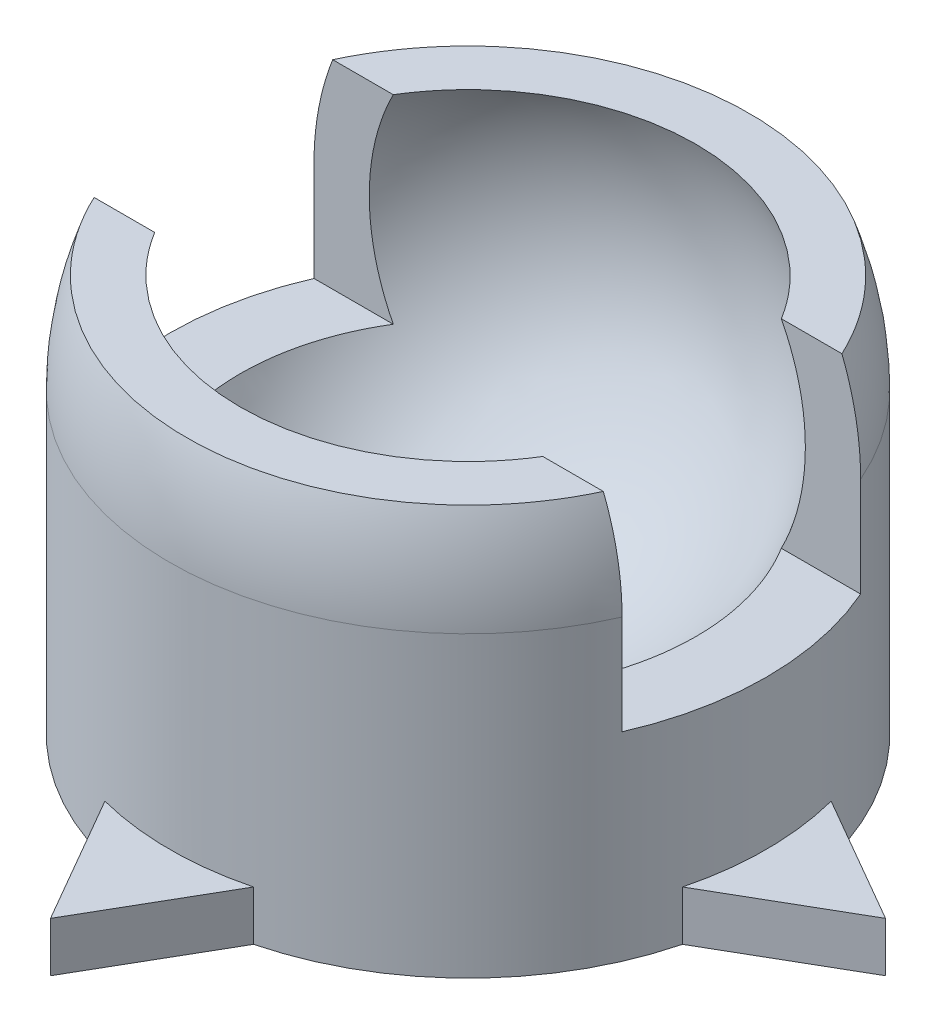
ISO-10303-21;
HEADER;
FILE_DESCRIPTION(('STEP AP214'),'2;1');
FILE_NAME('part.step','',(''),(''),'','','');
FILE_SCHEMA(('AUTOMOTIVE_DESIGN { 1 0 10303 214 1 1 1 1 }'));
ENDSEC;
DATA;
#1=APPLICATION_CONTEXT('core data for automotive mechanical design processes');
#2=APPLICATION_PROTOCOL_DEFINITION('international standard','automotive_design',2000,#1);
#3=PRODUCT_CONTEXT('',#1,'mechanical');
#4=PRODUCT('Part','Part','',(#3));
#5=PRODUCT_RELATED_PRODUCT_CATEGORY('part','',(#4));
#6=PRODUCT_DEFINITION_FORMATION('','',#4);
#7=PRODUCT_DEFINITION_CONTEXT('part definition',#1,'design');
#8=PRODUCT_DEFINITION('design','',#6,#7);
#9=PRODUCT_DEFINITION_SHAPE('','',#8);
#10=(LENGTH_UNIT() NAMED_UNIT(*) SI_UNIT(.MILLI.,.METRE.));
#11=(NAMED_UNIT(*) PLANE_ANGLE_UNIT() SI_UNIT($,.RADIAN.));
#12=(NAMED_UNIT(*) SI_UNIT($,.STERADIAN.) SOLID_ANGLE_UNIT());
#13=UNCERTAINTY_MEASURE_WITH_UNIT(LENGTH_MEASURE(1.E-05),#10,'distance_accuracy_value','');
#14=(GEOMETRIC_REPRESENTATION_CONTEXT(3) GLOBAL_UNCERTAINTY_ASSIGNED_CONTEXT((#13)) GLOBAL_UNIT_ASSIGNED_CONTEXT((#10,
#11,#12)) REPRESENTATION_CONTEXT('',''));
#15=CARTESIAN_POINT('',(0.,0.,0.));
#16=DIRECTION('',(0.,0.,1.));
#17=DIRECTION('',(1.,0.,0.));
#18=AXIS2_PLACEMENT_3D('',#15,#16,#17);
#19=CARTESIAN_POINT('',(0.,-7.5,0.));
#20=DIRECTION('',(0.,1.,0.));
#21=DIRECTION('',(0.,0.,1.));
#22=AXIS2_PLACEMENT_3D('',#19,#20,#21);
#23=CYLINDRICAL_SURFACE('',#22,7.5);
#24=CARTESIAN_POINT('',(0.,-2.5,0.));
#25=DIRECTION('',(0.,-1.,0.));
#26=DIRECTION('',(0.,0.,-1.));
#27=AXIS2_PLACEMENT_3D('',#24,#25,#26);
#28=CIRCLE('',#27,7.5);
#29=CARTESIAN_POINT('',(6.87386354243376,-2.5,3.));
#30=VERTEX_POINT('',#29);
#31=CARTESIAN_POINT('',(6.87386354243376,-2.5,-3.));
#32=VERTEX_POINT('',#31);
#33=EDGE_CURVE('E330',#30,#32,#28,.F.);
#34=ORIENTED_EDGE('',*,*,#33,.F.);
#35=DIRECTION('',(0.,1.,0.));
#36=VECTOR('',#35,1.);
#37=CARTESIAN_POINT('',(6.87386354243376,-7.5,3.));
#38=LINE('',#37,#36);
#39=CARTESIAN_POINT('',(6.87386354243376,0.,3.));
#40=VERTEX_POINT('',#39);
#41=EDGE_CURVE('E326',#40,#30,#38,.F.);
#42=ORIENTED_EDGE('',*,*,#41,.F.);
#43=CARTESIAN_POINT('',(0.,0.,0.));
#44=DIRECTION('',(0.,1.,0.));
#45=DIRECTION('',(0.,0.,1.));
#46=AXIS2_PLACEMENT_3D('',#43,#44,#45);
#47=CIRCLE('',#46,7.5);
#48=CARTESIAN_POINT('',(-6.87386354243376,0.,3.));
#49=VERTEX_POINT('',#48);
#50=EDGE_CURVE('E343',#49,#40,#47,.T.);
#51=ORIENTED_EDGE('',*,*,#50,.F.);
#52=DIRECTION('',(0.,1.,0.));
#53=VECTOR('',#52,1.);
#54=CARTESIAN_POINT('',(-6.87386354243376,-7.5,3.));
#55=LINE('',#54,#53);
#56=CARTESIAN_POINT('',(-6.87386354243376,-2.5,3.));
#57=VERTEX_POINT('',#56);
#58=EDGE_CURVE('E316',#57,#49,#55,.T.);
#59=ORIENTED_EDGE('',*,*,#58,.F.);
#60=CARTESIAN_POINT('',(-6.87386354243376,-2.5,-3.));
#61=VERTEX_POINT('',#60);
#62=EDGE_CURVE('E331',#61,#57,#28,.F.);
#63=ORIENTED_EDGE('',*,*,#62,.F.);
#64=DIRECTION('',(0.,1.,0.));
#65=VECTOR('',#64,1.);
#66=CARTESIAN_POINT('',(-6.87386354243376,-7.5,-3.));
#67=LINE('',#66,#65);
#68=CARTESIAN_POINT('',(-6.87386354243376,0.,-3.));
#69=VERTEX_POINT('',#68);
#70=EDGE_CURVE('E335',#69,#61,#67,.F.);
#71=ORIENTED_EDGE('',*,*,#70,.F.);
#72=CARTESIAN_POINT('',(6.87386354243376,0.,-3.));
#73=VERTEX_POINT('',#72);
#74=EDGE_CURVE('E354',#73,#69,#47,.T.);
#75=ORIENTED_EDGE('',*,*,#74,.F.);
#76=DIRECTION('',(0.,1.,0.));
#77=VECTOR('',#76,1.);
#78=CARTESIAN_POINT('',(6.87386354243376,-7.5,-3.));
#79=LINE('',#78,#77);
#80=EDGE_CURVE('E339',#32,#73,#79,.T.);
#81=ORIENTED_EDGE('',*,*,#80,.F.);
#82=EDGE_LOOP('',(#34,#42,#51,#59,#63,#71,#75,#81));
#83=FACE_BOUND('',#82,.T.);
#84=CARTESIAN_POINT('',(0.,-6.25,0.));
#85=DIRECTION('',(0.,-1.,0.));
#86=DIRECTION('',(0.,0.,1.));
#87=AXIS2_PLACEMENT_3D('',#84,#85,#86);
#88=CIRCLE('',#87,7.5);
#89=CARTESIAN_POINT('',(-1.86859770916472,-6.25,-7.26349382881987));
#90=VERTEX_POINT('',#89);
#91=CARTESIAN_POINT('',(1.86859770916472,-6.25,-7.26349382881987));
#92=VERTEX_POINT('',#91);
#93=EDGE_CURVE('E60',#90,#92,#88,.T.);
#94=ORIENTED_EDGE('',*,*,#93,.F.);
#95=DIRECTION('',(0.,-1.,0.));
#96=VECTOR('',#95,1.);
#97=CARTESIAN_POINT('',(-1.86859770916472,-6.25,-7.26349382881987));
#98=LINE('',#97,#96);
#99=CARTESIAN_POINT('',(-1.86859770916472,-7.5,-7.26349382881987));
#100=VERTEX_POINT('',#99);
#101=EDGE_CURVE('E211',#90,#100,#98,.T.);
#102=ORIENTED_EDGE('',*,*,#101,.T.);
#103=CARTESIAN_POINT('',(0.,-7.5,0.));
#104=DIRECTION('',(0.,1.,0.));
#105=DIRECTION('',(0.,0.,1.));
#106=AXIS2_PLACEMENT_3D('',#103,#104,#105);
#107=CIRCLE('',#106,7.5);
#108=CARTESIAN_POINT('',(-7.26349382881987,-7.5,-1.86859770916474));
#109=VERTEX_POINT('',#108);
#110=EDGE_CURVE('E349',#100,#109,#107,.T.);
#111=ORIENTED_EDGE('',*,*,#110,.T.);
#112=DIRECTION('',(0.,-1.,0.));
#113=VECTOR('',#112,1.);
#114=CARTESIAN_POINT('',(-7.26349382881987,-6.25,-1.86859770916474));
#115=LINE('',#114,#113);
#116=CARTESIAN_POINT('',(-7.26349382881987,-6.25,-1.86859770916474));
#117=VERTEX_POINT('',#116);
#118=EDGE_CURVE('E317',#117,#109,#115,.T.);
#119=ORIENTED_EDGE('',*,*,#118,.F.);
#120=CARTESIAN_POINT('',(0.,-6.25,0.));
#121=DIRECTION('',(0.,1.,0.));
#122=DIRECTION('',(0.,0.,-1.));
#123=AXIS2_PLACEMENT_3D('',#120,#121,#122);
#124=CIRCLE('',#123,7.5);
#125=CARTESIAN_POINT('',(-7.26349382881987,-6.25,1.86859770916474));
#126=VERTEX_POINT('',#125);
#127=EDGE_CURVE('E302',#117,#126,#124,.T.);
#128=ORIENTED_EDGE('',*,*,#127,.T.);
#129=DIRECTION('',(0.,-1.,0.));
#130=VECTOR('',#129,1.);
#131=CARTESIAN_POINT('',(-7.26349382881987,-6.25,1.86859770916474));
#132=LINE('',#131,#130);
#133=CARTESIAN_POINT('',(-7.26349382881987,-7.5,1.86859770916474));
#134=VERTEX_POINT('',#133);
#135=EDGE_CURVE('E312',#126,#134,#132,.T.);
#136=ORIENTED_EDGE('',*,*,#135,.T.);
#137=CARTESIAN_POINT('',(-1.86859770916472,-7.5,7.26349382881987));
#138=VERTEX_POINT('',#137);
#139=EDGE_CURVE('E344',#134,#138,#107,.T.);
#140=ORIENTED_EDGE('',*,*,#139,.T.);
#141=DIRECTION('',(0.,-1.,0.));
#142=VECTOR('',#141,1.);
#143=CARTESIAN_POINT('',(-1.86859770916472,-6.25,7.26349382881987));
#144=LINE('',#143,#142);
#145=CARTESIAN_POINT('',(-1.86859770916472,-6.25,7.26349382881987));
#146=VERTEX_POINT('',#145);
#147=EDGE_CURVE('E239',#146,#138,#144,.T.);
#148=ORIENTED_EDGE('',*,*,#147,.F.);
#149=CARTESIAN_POINT('',(0.,-6.25,0.));
#150=DIRECTION('',(0.,1.,0.));
#151=DIRECTION('',(0.,0.,-1.));
#152=AXIS2_PLACEMENT_3D('',#149,#150,#151);
#153=CIRCLE('',#152,7.5);
#154=CARTESIAN_POINT('',(1.86859770916472,-6.25,7.26349382881987));
#155=VERTEX_POINT('',#154);
#156=EDGE_CURVE('E231',#146,#155,#153,.T.);
#157=ORIENTED_EDGE('',*,*,#156,.T.);
#158=DIRECTION('',(0.,-1.,0.));
#159=VECTOR('',#158,1.);
#160=CARTESIAN_POINT('',(1.86859770916472,-6.25,7.26349382881987));
#161=LINE('',#160,#159);
#162=CARTESIAN_POINT('',(1.86859770916472,-7.5,7.26349382881987));
#163=VERTEX_POINT('',#162);
#164=EDGE_CURVE('E250',#155,#163,#161,.T.);
#165=ORIENTED_EDGE('',*,*,#164,.T.);
#166=CARTESIAN_POINT('',(7.26349382881987,-7.5,1.86859770916474));
#167=VERTEX_POINT('',#166);
#168=EDGE_CURVE('E348',#163,#167,#107,.T.);
#169=ORIENTED_EDGE('',*,*,#168,.T.);
#170=DIRECTION('',(0.,-1.,0.));
#171=VECTOR('',#170,1.);
#172=CARTESIAN_POINT('',(7.26349382881987,-6.25,1.86859770916474));
#173=LINE('',#172,#171);
#174=CARTESIAN_POINT('',(7.26349382881987,-6.25,1.86859770916474));
#175=VERTEX_POINT('',#174);
#176=EDGE_CURVE('E274',#175,#167,#173,.T.);
#177=ORIENTED_EDGE('',*,*,#176,.F.);
#178=CARTESIAN_POINT('',(0.,-6.25,0.));
#179=DIRECTION('',(0.,-1.,0.));
#180=DIRECTION('',(0.,0.,-1.));
#181=AXIS2_PLACEMENT_3D('',#178,#179,#180);
#182=CIRCLE('',#181,7.5);
#183=CARTESIAN_POINT('',(7.26349382881987,-6.25,-1.86859770916474));
#184=VERTEX_POINT('',#183);
#185=EDGE_CURVE('E265',#184,#175,#182,.T.);
#186=ORIENTED_EDGE('',*,*,#185,.F.);
#187=DIRECTION('',(0.,-1.,0.));
#188=VECTOR('',#187,1.);
#189=CARTESIAN_POINT('',(7.26349382881987,-6.25,-1.86859770916474));
#190=LINE('',#189,#188);
#191=CARTESIAN_POINT('',(7.26349382881987,-7.5,-1.86859770916474));
#192=VERTEX_POINT('',#191);
#193=EDGE_CURVE('E286',#184,#192,#190,.T.);
#194=ORIENTED_EDGE('',*,*,#193,.T.);
#195=CARTESIAN_POINT('',(1.86859770916472,-7.5,-7.26349382881987));
#196=VERTEX_POINT('',#195);
#197=EDGE_CURVE('E350',#192,#196,#107,.T.);
#198=ORIENTED_EDGE('',*,*,#197,.T.);
#199=DIRECTION('',(0.,-1.,0.));
#200=VECTOR('',#199,1.);
#201=CARTESIAN_POINT('',(1.86859770916472,-6.25,-7.26349382881987));
#202=LINE('',#201,#200);
#203=EDGE_CURVE('E65',#92,#196,#202,.T.);
#204=ORIENTED_EDGE('',*,*,#203,.F.);
#205=EDGE_LOOP('',(#94,#102,#111,#119,#128,#136,#140,#148,#157,#165,#169,#177,#186,#194,#198,#204));
#206=FACE_BOUND('',#205,.T.);
#207=ADVANCED_FACE('F43',(#83,#206),#23,.T.);
#208=CARTESIAN_POINT('',(0.,0.,0.));
#209=DIRECTION('',(1.,0.,0.));
#210=DIRECTION('',(0.,0.,-1.));
#211=AXIS2_PLACEMENT_3D('',#208,#209,#210);
#212=SPHERICAL_SURFACE('',#211,7.5);
#213=CARTESIAN_POINT('',(0.,0.,-3.));
#214=DIRECTION('',(0.,0.,-1.));
#215=DIRECTION('',(0.,1.,0.));
#216=AXIS2_PLACEMENT_3D('',#213,#214,#215);
#217=CIRCLE('',#216,6.87386354243376);
#218=CARTESIAN_POINT('',(6.40312423743285,2.5,-3.));
#219=VERTEX_POINT('',#218);
#220=EDGE_CURVE('E11',#219,#73,#217,.T.);
#221=ORIENTED_EDGE('',*,*,#220,.T.);
#222=ORIENTED_EDGE('',*,*,#74,.T.);
#223=CARTESIAN_POINT('',(-6.40312423743285,2.5,-3.));
#224=VERTEX_POINT('',#223);
#225=EDGE_CURVE('E47',#69,#224,#217,.T.);
#226=ORIENTED_EDGE('',*,*,#225,.T.);
#227=CARTESIAN_POINT('',(0.,2.5,0.));
#228=DIRECTION('',(0.,-1.,0.));
#229=DIRECTION('',(0.,0.,-1.));
#230=AXIS2_PLACEMENT_3D('',#227,#228,#229);
#231=CIRCLE('',#230,7.07106781186548);
#232=EDGE_CURVE('E391',#224,#219,#231,.T.);
#233=ORIENTED_EDGE('',*,*,#232,.T.);
#234=EDGE_LOOP('',(#221,#222,#226,#233));
#235=FACE_BOUND('',#234,.T.);
#236=ADVANCED_FACE('F472',(#235),#212,.T.);
#237=CARTESIAN_POINT('',(0.,2.5,0.));
#238=DIRECTION('',(0.,-1.,0.));
#239=DIRECTION('',(0.,0.,-1.));
#240=AXIS2_PLACEMENT_3D('',#237,#238,#239);
#241=PLANE('',#240);
#242=ORIENTED_EDGE('',*,*,#232,.F.);
#243=DIRECTION('',(1.,0.,0.));
#244=VECTOR('',#243,1.);
#245=CARTESIAN_POINT('',(-12.5,2.5,-3.));
#246=LINE('',#245,#244);
#247=CARTESIAN_POINT('',(-4.87980532398579,2.5,-3.));
#248=VERTEX_POINT('',#247);
#249=EDGE_CURVE('E372',#224,#248,#246,.T.);
#250=ORIENTED_EDGE('',*,*,#249,.T.);
#251=CARTESIAN_POINT('',(0.,2.5,0.));
#252=DIRECTION('',(0.,-1.,0.));
#253=DIRECTION('',(0.,0.,-1.));
#254=AXIS2_PLACEMENT_3D('',#251,#252,#253);
#255=CIRCLE('',#254,5.7282196186948);
#256=CARTESIAN_POINT('',(4.87980532398579,2.5,-3.));
#257=VERTEX_POINT('',#256);
#258=EDGE_CURVE('E397',#257,#248,#255,.F.);
#259=ORIENTED_EDGE('',*,*,#258,.F.);
#260=EDGE_CURVE('E358',#257,#219,#246,.T.);
#261=ORIENTED_EDGE('',*,*,#260,.T.);
#262=EDGE_LOOP('',(#242,#250,#259,#261));
#263=FACE_BOUND('',#262,.T.);
#264=ADVANCED_FACE('F448',(#263),#241,.F.);
#265=CARTESIAN_POINT('',(0.,0.,0.));
#266=DIRECTION('',(1.,0.,0.));
#267=DIRECTION('',(0.,0.,1.));
#268=AXIS2_PLACEMENT_3D('',#265,#266,#267);
#269=SPHERICAL_SURFACE('',#268,6.25);
#270=CARTESIAN_POINT('',(0.,-6.0673305497558,0.));
#271=DIRECTION('',(0.,1.,0.));
#272=DIRECTION('',(0.,0.,1.));
#273=AXIS2_PLACEMENT_3D('',#270,#271,#272);
#274=CIRCLE('',#273,1.5);
#275=CARTESIAN_POINT('',(0.,-6.0673305497558,1.5));
#276=VERTEX_POINT('',#275);
#277=EDGE_CURVE('E347',#276,#276,#274,.F.);
#278=ORIENTED_EDGE('',*,*,#277,.T.);
#279=EDGE_LOOP('',(#278));
#280=FACE_BOUND('',#279,.T.);
#281=ORIENTED_EDGE('',*,*,#258,.T.);
#282=CARTESIAN_POINT('',(0.,0.,-3.));
#283=DIRECTION('',(0.,0.,-1.));
#284=DIRECTION('',(0.,1.,0.));
#285=AXIS2_PLACEMENT_3D('',#282,#283,#284);
#286=CIRCLE('',#285,5.48292804986533);
#287=CARTESIAN_POINT('',(-4.87980532398578,-2.5,-3.));
#288=VERTEX_POINT('',#287);
#289=EDGE_CURVE('E390',#248,#288,#286,.F.);
#290=ORIENTED_EDGE('',*,*,#289,.T.);
#291=CARTESIAN_POINT('',(0.,-2.5,0.));
#292=DIRECTION('',(0.,-1.,0.));
#293=DIRECTION('',(0.,0.,-1.));
#294=AXIS2_PLACEMENT_3D('',#291,#292,#293);
#295=CIRCLE('',#294,5.7282196186948);
#296=CARTESIAN_POINT('',(-4.87980532398578,-2.5,3.));
#297=VERTEX_POINT('',#296);
#298=EDGE_CURVE('E385',#288,#297,#295,.F.);
#299=ORIENTED_EDGE('',*,*,#298,.T.);
#300=CARTESIAN_POINT('',(0.,0.,3.));
#301=DIRECTION('',(0.,0.,1.));
#302=DIRECTION('',(0.,-1.,0.));
#303=AXIS2_PLACEMENT_3D('',#300,#301,#302);
#304=CIRCLE('',#303,5.48292804986533);
#305=CARTESIAN_POINT('',(-4.87980532398578,2.5,3.));
#306=VERTEX_POINT('',#305);
#307=EDGE_CURVE('E380',#297,#306,#304,.F.);
#308=ORIENTED_EDGE('',*,*,#307,.T.);
#309=CARTESIAN_POINT('',(4.87980532398578,2.5,3.));
#310=VERTEX_POINT('',#309);
#311=EDGE_CURVE('E396',#306,#310,#255,.F.);
#312=ORIENTED_EDGE('',*,*,#311,.T.);
#313=CARTESIAN_POINT('',(4.87980532398578,-2.5,3.));
#314=VERTEX_POINT('',#313);
#315=EDGE_CURVE('E376',#310,#314,#304,.F.);
#316=ORIENTED_EDGE('',*,*,#315,.T.);
#317=CARTESIAN_POINT('',(4.87980532398578,-2.5,-3.));
#318=VERTEX_POINT('',#317);
#319=EDGE_CURVE('E381',#314,#318,#295,.F.);
#320=ORIENTED_EDGE('',*,*,#319,.T.);
#321=EDGE_CURVE('E386',#318,#257,#286,.F.);
#322=ORIENTED_EDGE('',*,*,#321,.T.);
#323=EDGE_LOOP('',(#281,#290,#299,#308,#312,#316,#320,#322));
#324=FACE_BOUND('',#323,.T.);
#325=ADVANCED_FACE('F45',(#280,#324),#269,.F.);
#326=CARTESIAN_POINT('',(6.40312423743285,2.5,3.));
#327=VERTEX_POINT('',#326);
#328=CARTESIAN_POINT('',(-6.40312423743285,2.5,3.));
#329=VERTEX_POINT('',#328);
#330=EDGE_CURVE('E395',#327,#329,#231,.T.);
#331=ORIENTED_EDGE('',*,*,#330,.F.);
#332=DIRECTION('',(1.,0.,0.));
#333=VECTOR('',#332,1.);
#334=CARTESIAN_POINT('',(-12.5,2.5,3.));
#335=LINE('',#334,#333);
#336=EDGE_CURVE('E368',#310,#327,#335,.T.);
#337=ORIENTED_EDGE('',*,*,#336,.F.);
#338=ORIENTED_EDGE('',*,*,#311,.F.);
#339=EDGE_CURVE('E367',#329,#306,#335,.T.);
#340=ORIENTED_EDGE('',*,*,#339,.F.);
#341=EDGE_LOOP('',(#331,#337,#338,#340));
#342=FACE_BOUND('',#341,.T.);
#343=ADVANCED_FACE('F419',(#342),#241,.F.);
#344=CARTESIAN_POINT('',(0.,0.,3.));
#345=DIRECTION('',(0.,0.,1.));
#346=DIRECTION('',(0.,-1.,0.));
#347=AXIS2_PLACEMENT_3D('',#344,#345,#346);
#348=CIRCLE('',#347,6.87386354243376);
#349=EDGE_CURVE('E400',#329,#49,#348,.T.);
#350=ORIENTED_EDGE('',*,*,#349,.T.);
#351=ORIENTED_EDGE('',*,*,#50,.T.);
#352=EDGE_CURVE('E53',#40,#327,#348,.T.);
#353=ORIENTED_EDGE('',*,*,#352,.T.);
#354=ORIENTED_EDGE('',*,*,#330,.T.);
#355=EDGE_LOOP('',(#350,#351,#353,#354));
#356=FACE_BOUND('',#355,.T.);
#357=ADVANCED_FACE('F407',(#356),#212,.T.);
#358=CARTESIAN_POINT('',(-12.5,2.5,3.));
#359=DIRECTION('',(0.,0.,1.));
#360=DIRECTION('',(0.,-1.,0.));
#361=AXIS2_PLACEMENT_3D('',#358,#359,#360);
#362=PLANE('',#361);
#363=DIRECTION('',(1.,0.,0.));
#364=VECTOR('',#363,1.);
#365=CARTESIAN_POINT('',(-12.5,-2.5,3.));
#366=LINE('',#365,#364);
#367=EDGE_CURVE('E363',#57,#297,#366,.T.);
#368=ORIENTED_EDGE('',*,*,#367,.F.);
#369=ORIENTED_EDGE('',*,*,#58,.T.);
#370=ORIENTED_EDGE('',*,*,#349,.F.);
#371=ORIENTED_EDGE('',*,*,#339,.T.);
#372=ORIENTED_EDGE('',*,*,#307,.F.);
#373=EDGE_LOOP('',(#368,#369,#370,#371,#372));
#374=FACE_BOUND('',#373,.T.);
#375=ADVANCED_FACE('F464',(#374),#362,.F.);
#376=CARTESIAN_POINT('',(-12.5,-2.5,3.));
#377=DIRECTION('',(0.,-1.,0.));
#378=DIRECTION('',(0.,0.,-1.));
#379=AXIS2_PLACEMENT_3D('',#376,#377,#378);
#380=PLANE('',#379);
#381=ORIENTED_EDGE('',*,*,#298,.F.);
#382=DIRECTION('',(1.,0.,0.));
#383=VECTOR('',#382,1.);
#384=CARTESIAN_POINT('',(-12.5,-2.5,-3.));
#385=LINE('',#384,#383);
#386=EDGE_CURVE('E362',#61,#288,#385,.T.);
#387=ORIENTED_EDGE('',*,*,#386,.F.);
#388=ORIENTED_EDGE('',*,*,#62,.T.);
#389=ORIENTED_EDGE('',*,*,#367,.T.);
#390=EDGE_LOOP('',(#381,#387,#388,#389));
#391=FACE_BOUND('',#390,.T.);
#392=ADVANCED_FACE('F461',(#391),#380,.F.);
#393=CARTESIAN_POINT('',(-12.5,-2.5,-3.));
#394=DIRECTION('',(0.,0.,-1.));
#395=DIRECTION('',(0.,1.,0.));
#396=AXIS2_PLACEMENT_3D('',#393,#394,#395);
#397=PLANE('',#396);
#398=ORIENTED_EDGE('',*,*,#225,.F.);
#399=ORIENTED_EDGE('',*,*,#70,.T.);
#400=ORIENTED_EDGE('',*,*,#386,.T.);
#401=ORIENTED_EDGE('',*,*,#289,.F.);
#402=ORIENTED_EDGE('',*,*,#249,.F.);
#403=EDGE_LOOP('',(#398,#399,#400,#401,#402));
#404=FACE_BOUND('',#403,.T.);
#405=ADVANCED_FACE('F452',(#404),#397,.F.);
#406=EDGE_CURVE('E359',#318,#32,#385,.T.);
#407=ORIENTED_EDGE('',*,*,#406,.T.);
#408=ORIENTED_EDGE('',*,*,#80,.T.);
#409=ORIENTED_EDGE('',*,*,#220,.F.);
#410=ORIENTED_EDGE('',*,*,#260,.F.);
#411=ORIENTED_EDGE('',*,*,#321,.F.);
#412=EDGE_LOOP('',(#407,#408,#409,#410,#411));
#413=FACE_BOUND('',#412,.T.);
#414=ADVANCED_FACE('F442',(#413),#397,.F.);
#415=EDGE_CURVE('E364',#314,#30,#366,.T.);
#416=ORIENTED_EDGE('',*,*,#415,.T.);
#417=ORIENTED_EDGE('',*,*,#33,.T.);
#418=ORIENTED_EDGE('',*,*,#406,.F.);
#419=ORIENTED_EDGE('',*,*,#319,.F.);
#420=EDGE_LOOP('',(#416,#417,#418,#419));
#421=FACE_BOUND('',#420,.T.);
#422=ADVANCED_FACE('F437',(#421),#380,.F.);
#423=ORIENTED_EDGE('',*,*,#352,.F.);
#424=ORIENTED_EDGE('',*,*,#41,.T.);
#425=ORIENTED_EDGE('',*,*,#415,.F.);
#426=ORIENTED_EDGE('',*,*,#315,.F.);
#427=ORIENTED_EDGE('',*,*,#336,.T.);
#428=EDGE_LOOP('',(#423,#424,#425,#426,#427));
#429=FACE_BOUND('',#428,.T.);
#430=ADVANCED_FACE('F413',(#429),#362,.F.);
#431=CARTESIAN_POINT('',(0.,7.5,0.));
#432=DIRECTION('',(0.,-1.,0.));
#433=DIRECTION('',(0.,0.,-1.));
#434=AXIS2_PLACEMENT_3D('',#431,#432,#433);
#435=CYLINDRICAL_SURFACE('',#434,1.5);
#436=ORIENTED_EDGE('',*,*,#277,.F.);
#437=EDGE_LOOP('',(#436));
#438=FACE_BOUND('',#437,.T.);
#439=CARTESIAN_POINT('',(0.,-7.5,0.));
#440=DIRECTION('',(0.,-1.,0.));
#441=DIRECTION('',(0.,0.,-1.));
#442=AXIS2_PLACEMENT_3D('',#439,#440,#441);
#443=CIRCLE('',#442,1.5);
#444=CARTESIAN_POINT('',(0.,-7.5,-1.5));
#445=VERTEX_POINT('',#444);
#446=EDGE_CURVE('E249',#445,#445,#443,.T.);
#447=ORIENTED_EDGE('',*,*,#446,.T.);
#448=EDGE_LOOP('',(#447));
#449=FACE_BOUND('',#448,.T.);
#450=ADVANCED_FACE('F475',(#438,#449),#435,.F.);
#451=CARTESIAN_POINT('',(0.,-7.5,0.));
#452=DIRECTION('',(0.,1.,0.));
#453=DIRECTION('',(0.,0.,1.));
#454=AXIS2_PLACEMENT_3D('',#451,#452,#453);
#455=PLANE('',#454);
#456=ORIENTED_EDGE('',*,*,#446,.F.);
#457=EDGE_LOOP('',(#456));
#458=FACE_BOUND('',#457,.T.);
#459=ORIENTED_EDGE('',*,*,#139,.F.);
#460=DIRECTION('',(-0.866025403784438,0.,-0.500000000000001));
#461=VECTOR('',#460,1.);
#462=CARTESIAN_POINT('',(-10.5,-7.5,0.));
#463=LINE('',#462,#461);
#464=CARTESIAN_POINT('',(-10.5,-7.5,0.));
#465=VERTEX_POINT('',#464);
#466=EDGE_CURVE('E285',#134,#465,#463,.T.);
#467=ORIENTED_EDGE('',*,*,#466,.T.);
#468=DIRECTION('',(0.866025403784438,0.,-0.500000000000001));
#469=VECTOR('',#468,1.);
#470=CARTESIAN_POINT('',(-10.5,-7.5,0.));
#471=LINE('',#470,#469);
#472=EDGE_CURVE('E298',#465,#109,#471,.T.);
#473=ORIENTED_EDGE('',*,*,#472,.T.);
#474=ORIENTED_EDGE('',*,*,#110,.F.);
#475=DIRECTION('',(-0.499999999999998,0.,0.866025403784439));
#476=VECTOR('',#475,1.);
#477=CARTESIAN_POINT('',(0.,-7.5,-10.5));
#478=LINE('',#477,#476);
#479=CARTESIAN_POINT('',(0.,-7.5,-10.5));
#480=VERTEX_POINT('',#479);
#481=EDGE_CURVE('E215',#480,#100,#478,.T.);
#482=ORIENTED_EDGE('',*,*,#481,.F.);
#483=DIRECTION('',(-0.499999999999998,0.,-0.86602540378444));
#484=VECTOR('',#483,1.);
#485=CARTESIAN_POINT('',(0.,-7.5,-10.5));
#486=LINE('',#485,#484);
#487=EDGE_CURVE('E204',#196,#480,#486,.T.);
#488=ORIENTED_EDGE('',*,*,#487,.F.);
#489=ORIENTED_EDGE('',*,*,#197,.F.);
#490=DIRECTION('',(-0.866025403784438,0.,-0.500000000000001));
#491=VECTOR('',#490,1.);
#492=CARTESIAN_POINT('',(10.5,-7.5,0.));
#493=LINE('',#492,#491);
#494=CARTESIAN_POINT('',(10.5,-7.5,0.));
#495=VERTEX_POINT('',#494);
#496=EDGE_CURVE('E266',#495,#192,#493,.T.);
#497=ORIENTED_EDGE('',*,*,#496,.F.);
#498=DIRECTION('',(0.866025403784438,0.,-0.500000000000001));
#499=VECTOR('',#498,1.);
#500=CARTESIAN_POINT('',(10.5,-7.5,0.));
#501=LINE('',#500,#499);
#502=EDGE_CURVE('E260',#167,#495,#501,.T.);
#503=ORIENTED_EDGE('',*,*,#502,.F.);
#504=ORIENTED_EDGE('',*,*,#168,.F.);
#505=DIRECTION('',(-0.499999999999998,0.,0.86602540378444));
#506=VECTOR('',#505,1.);
#507=CARTESIAN_POINT('',(0.,-7.5,10.5));
#508=LINE('',#507,#506);
#509=CARTESIAN_POINT('',(0.,-7.5,10.5));
#510=VERTEX_POINT('',#509);
#511=EDGE_CURVE('E232',#163,#510,#508,.T.);
#512=ORIENTED_EDGE('',*,*,#511,.T.);
#513=DIRECTION('',(-0.499999999999998,0.,-0.866025403784439));
#514=VECTOR('',#513,1.);
#515=CARTESIAN_POINT('',(0.,-7.5,10.5));
#516=LINE('',#515,#514);
#517=EDGE_CURVE('E224',#510,#138,#516,.T.);
#518=ORIENTED_EDGE('',*,*,#517,.T.);
#519=EDGE_LOOP('',(#459,#467,#473,#474,#482,#488,#489,#497,#503,#504,#512,#518));
#520=FACE_BOUND('',#519,.T.);
#521=ADVANCED_FACE('F484',(#458,#520),#455,.F.);
#522=CARTESIAN_POINT('',(-10.5,-6.25,0.));
#523=DIRECTION('',(-0.500000000000001,0.,0.866025403784438));
#524=DIRECTION('',(0.866025403784438,0.,0.500000000000001));
#525=AXIS2_PLACEMENT_3D('',#522,#523,#524);
#526=PLANE('',#525);
#527=ORIENTED_EDGE('',*,*,#466,.F.);
#528=ORIENTED_EDGE('',*,*,#135,.F.);
#529=DIRECTION('',(-0.866025403784438,0.,-0.500000000000001));
#530=VECTOR('',#529,1.);
#531=CARTESIAN_POINT('',(-10.5,-6.25,0.));
#532=LINE('',#531,#530);
#533=CARTESIAN_POINT('',(-10.5,-6.25,0.));
#534=VERTEX_POINT('',#533);
#535=EDGE_CURVE('E293',#126,#534,#532,.T.);
#536=ORIENTED_EDGE('',*,*,#535,.T.);
#537=DIRECTION('',(0.,-1.,0.));
#538=VECTOR('',#537,1.);
#539=CARTESIAN_POINT('',(-10.5,-6.25,0.));
#540=LINE('',#539,#538);
#541=EDGE_CURVE('E305',#534,#465,#540,.T.);
#542=ORIENTED_EDGE('',*,*,#541,.T.);
#543=EDGE_LOOP('',(#527,#528,#536,#542));
#544=FACE_BOUND('',#543,.T.);
#545=ADVANCED_FACE('F491',(#544),#526,.T.);
#546=CARTESIAN_POINT('',(-10.5,-6.25,0.));
#547=DIRECTION('',(-0.500000000000001,0.,-0.866025403784438));
#548=DIRECTION('',(-0.866025403784438,0.,0.500000000000001));
#549=AXIS2_PLACEMENT_3D('',#546,#547,#548);
#550=PLANE('',#549);
#551=ORIENTED_EDGE('',*,*,#472,.F.);
#552=ORIENTED_EDGE('',*,*,#541,.F.);
#553=DIRECTION('',(0.866025403784438,0.,-0.500000000000001));
#554=VECTOR('',#553,1.);
#555=CARTESIAN_POINT('',(-10.5,-6.25,0.));
#556=LINE('',#555,#554);
#557=EDGE_CURVE('E297',#534,#117,#556,.T.);
#558=ORIENTED_EDGE('',*,*,#557,.T.);
#559=ORIENTED_EDGE('',*,*,#118,.T.);
#560=EDGE_LOOP('',(#551,#552,#558,#559));
#561=FACE_BOUND('',#560,.T.);
#562=ADVANCED_FACE('F506',(#561),#550,.T.);
#563=CARTESIAN_POINT('',(0.,-6.25,0.));
#564=DIRECTION('',(0.,-1.,0.));
#565=DIRECTION('',(0.,0.,-1.));
#566=AXIS2_PLACEMENT_3D('',#563,#564,#565);
#567=PLANE('',#566);
#568=ORIENTED_EDGE('',*,*,#535,.F.);
#569=ORIENTED_EDGE('',*,*,#127,.F.);
#570=ORIENTED_EDGE('',*,*,#557,.F.);
#571=EDGE_LOOP('',(#568,#569,#570));
#572=FACE_BOUND('',#571,.T.);
#573=ADVANCED_FACE('F508',(#572),#567,.F.);
#574=CARTESIAN_POINT('',(10.5,-6.25,0.));
#575=DIRECTION('',(-0.500000000000001,0.,-0.866025403784438));
#576=DIRECTION('',(-0.866025403784438,0.,0.500000000000001));
#577=AXIS2_PLACEMENT_3D('',#574,#575,#576);
#578=PLANE('',#577);
#579=ORIENTED_EDGE('',*,*,#502,.T.);
#580=DIRECTION('',(0.,-1.,0.));
#581=VECTOR('',#580,1.);
#582=CARTESIAN_POINT('',(10.5,-6.25,0.));
#583=LINE('',#582,#581);
#584=CARTESIAN_POINT('',(10.5,-6.25,0.));
#585=VERTEX_POINT('',#584);
#586=EDGE_CURVE('E281',#585,#495,#583,.T.);
#587=ORIENTED_EDGE('',*,*,#586,.F.);
#588=DIRECTION('',(0.866025403784438,0.,-0.500000000000001));
#589=VECTOR('',#588,1.);
#590=CARTESIAN_POINT('',(10.5,-6.25,0.));
#591=LINE('',#590,#589);
#592=EDGE_CURVE('E261',#175,#585,#591,.T.);
#593=ORIENTED_EDGE('',*,*,#592,.F.);
#594=ORIENTED_EDGE('',*,*,#176,.T.);
#595=EDGE_LOOP('',(#579,#587,#593,#594));
#596=FACE_BOUND('',#595,.T.);
#597=ADVANCED_FACE('F510',(#596),#578,.F.);
#598=CARTESIAN_POINT('',(10.5,-6.25,0.));
#599=DIRECTION('',(-0.500000000000001,0.,0.866025403784438));
#600=DIRECTION('',(0.866025403784438,0.,0.500000000000001));
#601=AXIS2_PLACEMENT_3D('',#598,#599,#600);
#602=PLANE('',#601);
#603=ORIENTED_EDGE('',*,*,#496,.T.);
#604=ORIENTED_EDGE('',*,*,#193,.F.);
#605=DIRECTION('',(-0.866025403784438,0.,-0.500000000000001));
#606=VECTOR('',#605,1.);
#607=CARTESIAN_POINT('',(10.5,-6.25,0.));
#608=LINE('',#607,#606);
#609=EDGE_CURVE('E270',#585,#184,#608,.T.);
#610=ORIENTED_EDGE('',*,*,#609,.F.);
#611=ORIENTED_EDGE('',*,*,#586,.T.);
#612=EDGE_LOOP('',(#603,#604,#610,#611));
#613=FACE_BOUND('',#612,.T.);
#614=ADVANCED_FACE('F516',(#613),#602,.F.);
#615=CARTESIAN_POINT('',(0.,-6.25,0.));
#616=DIRECTION('',(0.,-1.,0.));
#617=DIRECTION('',(0.,0.,-1.));
#618=AXIS2_PLACEMENT_3D('',#615,#616,#617);
#619=PLANE('',#618);
#620=ORIENTED_EDGE('',*,*,#592,.T.);
#621=ORIENTED_EDGE('',*,*,#609,.T.);
#622=ORIENTED_EDGE('',*,*,#185,.T.);
#623=EDGE_LOOP('',(#620,#621,#622));
#624=FACE_BOUND('',#623,.T.);
#625=ADVANCED_FACE('F549',(#624),#619,.F.);
#626=CARTESIAN_POINT('',(0.,-6.25,10.5));
#627=DIRECTION('',(-0.866025403784439,0.,0.499999999999998));
#628=DIRECTION('',(0.499999999999999,0.,0.86602540378444));
#629=AXIS2_PLACEMENT_3D('',#626,#627,#628);
#630=PLANE('',#629);
#631=ORIENTED_EDGE('',*,*,#517,.F.);
#632=DIRECTION('',(0.,-1.,0.));
#633=VECTOR('',#632,1.);
#634=CARTESIAN_POINT('',(0.,-6.25,10.5));
#635=LINE('',#634,#633);
#636=CARTESIAN_POINT('',(0.,-6.25,10.5));
#637=VERTEX_POINT('',#636);
#638=EDGE_CURVE('E246',#637,#510,#635,.T.);
#639=ORIENTED_EDGE('',*,*,#638,.F.);
#640=DIRECTION('',(-0.499999999999998,0.,-0.866025403784439));
#641=VECTOR('',#640,1.);
#642=CARTESIAN_POINT('',(0.,-6.25,10.5));
#643=LINE('',#642,#641);
#644=EDGE_CURVE('E227',#637,#146,#643,.T.);
#645=ORIENTED_EDGE('',*,*,#644,.T.);
#646=ORIENTED_EDGE('',*,*,#147,.T.);
#647=EDGE_LOOP('',(#631,#639,#645,#646));
#648=FACE_BOUND('',#647,.T.);
#649=ADVANCED_FACE('F558',(#648),#630,.T.);
#650=CARTESIAN_POINT('',(0.,-6.25,10.5));
#651=DIRECTION('',(0.86602540378444,0.,0.499999999999998));
#652=DIRECTION('',(0.499999999999998,0.,-0.86602540378444));
#653=AXIS2_PLACEMENT_3D('',#650,#651,#652);
#654=PLANE('',#653);
#655=ORIENTED_EDGE('',*,*,#511,.F.);
#656=ORIENTED_EDGE('',*,*,#164,.F.);
#657=DIRECTION('',(-0.499999999999998,0.,0.86602540378444));
#658=VECTOR('',#657,1.);
#659=CARTESIAN_POINT('',(0.,-6.25,10.5));
#660=LINE('',#659,#658);
#661=EDGE_CURVE('E235',#155,#637,#660,.T.);
#662=ORIENTED_EDGE('',*,*,#661,.T.);
#663=ORIENTED_EDGE('',*,*,#638,.T.);
#664=EDGE_LOOP('',(#655,#656,#662,#663));
#665=FACE_BOUND('',#664,.T.);
#666=ADVANCED_FACE('F569',(#665),#654,.T.);
#667=CARTESIAN_POINT('',(0.,-6.25,0.));
#668=DIRECTION('',(0.,-1.,0.));
#669=DIRECTION('',(0.,0.,-1.));
#670=AXIS2_PLACEMENT_3D('',#667,#668,#669);
#671=PLANE('',#670);
#672=ORIENTED_EDGE('',*,*,#644,.F.);
#673=ORIENTED_EDGE('',*,*,#661,.F.);
#674=ORIENTED_EDGE('',*,*,#156,.F.);
#675=EDGE_LOOP('',(#672,#673,#674));
#676=FACE_BOUND('',#675,.T.);
#677=ADVANCED_FACE('F580',(#676),#671,.F.);
#678=CARTESIAN_POINT('',(0.,-6.25,-10.5));
#679=DIRECTION('',(0.866025403784439,0.,0.499999999999998));
#680=DIRECTION('',(0.499999999999999,0.,-0.86602540378444));
#681=AXIS2_PLACEMENT_3D('',#678,#679,#680);
#682=PLANE('',#681);
#683=ORIENTED_EDGE('',*,*,#481,.T.);
#684=ORIENTED_EDGE('',*,*,#101,.F.);
#685=DIRECTION('',(-0.499999999999998,0.,0.866025403784439));
#686=VECTOR('',#685,1.);
#687=CARTESIAN_POINT('',(0.,-6.25,-10.5));
#688=LINE('',#687,#686);
#689=CARTESIAN_POINT('',(0.,-6.25,-10.5));
#690=VERTEX_POINT('',#689);
#691=EDGE_CURVE('E195',#690,#90,#688,.T.);
#692=ORIENTED_EDGE('',*,*,#691,.F.);
#693=DIRECTION('',(0.,-1.,0.));
#694=VECTOR('',#693,1.);
#695=CARTESIAN_POINT('',(0.,-6.25,-10.5));
#696=LINE('',#695,#694);
#697=EDGE_CURVE('E201',#690,#480,#696,.T.);
#698=ORIENTED_EDGE('',*,*,#697,.T.);
#699=EDGE_LOOP('',(#683,#684,#692,#698));
#700=FACE_BOUND('',#699,.T.);
#701=ADVANCED_FACE('F210',(#700),#682,.F.);
#702=CARTESIAN_POINT('',(0.,-6.25,-10.5));
#703=DIRECTION('',(-0.86602540378444,0.,0.499999999999998));
#704=DIRECTION('',(0.499999999999998,0.,0.86602540378444));
#705=AXIS2_PLACEMENT_3D('',#702,#703,#704);
#706=PLANE('',#705);
#707=ORIENTED_EDGE('',*,*,#487,.T.);
#708=ORIENTED_EDGE('',*,*,#697,.F.);
#709=DIRECTION('',(-0.499999999999998,0.,-0.86602540378444));
#710=VECTOR('',#709,1.);
#711=CARTESIAN_POINT('',(0.,-6.25,-10.5));
#712=LINE('',#711,#710);
#713=EDGE_CURVE('E191',#92,#690,#712,.T.);
#714=ORIENTED_EDGE('',*,*,#713,.F.);
#715=ORIENTED_EDGE('',*,*,#203,.T.);
#716=EDGE_LOOP('',(#707,#708,#714,#715));
#717=FACE_BOUND('',#716,.T.);
#718=ADVANCED_FACE('F202',(#717),#706,.F.);
#719=CARTESIAN_POINT('',(0.,-6.25,0.));
#720=DIRECTION('',(0.,-1.,0.));
#721=DIRECTION('',(0.,0.,1.));
#722=AXIS2_PLACEMENT_3D('',#719,#720,#721);
#723=PLANE('',#722);
#724=ORIENTED_EDGE('',*,*,#691,.T.);
#725=ORIENTED_EDGE('',*,*,#93,.T.);
#726=ORIENTED_EDGE('',*,*,#713,.T.);
#727=EDGE_LOOP('',(#724,#725,#726));
#728=FACE_BOUND('',#727,.T.);
#729=ADVANCED_FACE('F193',(#728),#723,.F.);
#730=CLOSED_SHELL('',(#207,#236,#264,#325,#343,#357,#375,#392,#405,#414,#422,#430,#450,#521,
#545,#562,#573,#597,#614,#625,#649,#666,#677,#701,#718,#729));
#731=MANIFOLD_SOLID_BREP('B2',#730);
#732=ADVANCED_BREP_SHAPE_REPRESENTATION('',(#18,#731),#14);
#733=SHAPE_DEFINITION_REPRESENTATION(#9,#732);
ENDSEC;
END-ISO-10303-21;
